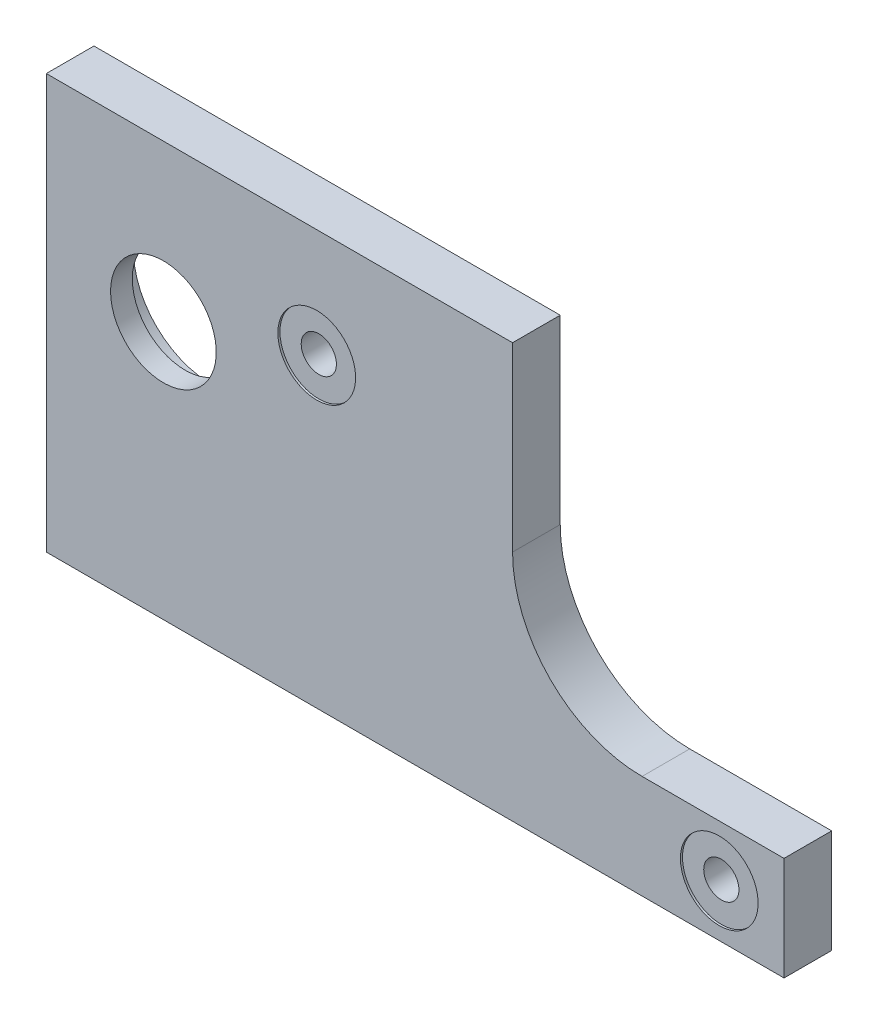
ISO-10303-21;
HEADER;
FILE_DESCRIPTION(('STEP AP214'),'2;1');
FILE_NAME('part.step','',(''),(''),'','','');
FILE_SCHEMA(('AUTOMOTIVE_DESIGN { 1 0 10303 214 1 1 1 1 }'));
ENDSEC;
DATA;
#1=APPLICATION_CONTEXT('core data for automotive mechanical design processes');
#2=APPLICATION_PROTOCOL_DEFINITION('international standard','automotive_design',2000,#1);
#3=PRODUCT_CONTEXT('',#1,'mechanical');
#4=PRODUCT('Part','Part','',(#3));
#5=PRODUCT_RELATED_PRODUCT_CATEGORY('part','',(#4));
#6=PRODUCT_DEFINITION_FORMATION('','',#4);
#7=PRODUCT_DEFINITION_CONTEXT('part definition',#1,'design');
#8=PRODUCT_DEFINITION('design','',#6,#7);
#9=PRODUCT_DEFINITION_SHAPE('','',#8);
#10=(LENGTH_UNIT() NAMED_UNIT(*) SI_UNIT(.MILLI.,.METRE.));
#11=(NAMED_UNIT(*) PLANE_ANGLE_UNIT() SI_UNIT($,.RADIAN.));
#12=(NAMED_UNIT(*) SI_UNIT($,.STERADIAN.) SOLID_ANGLE_UNIT());
#13=UNCERTAINTY_MEASURE_WITH_UNIT(LENGTH_MEASURE(1.E-05),#10,'distance_accuracy_value','');
#14=(GEOMETRIC_REPRESENTATION_CONTEXT(3) GLOBAL_UNCERTAINTY_ASSIGNED_CONTEXT((#13)) GLOBAL_UNIT_ASSIGNED_CONTEXT((#10,
#11,#12)) REPRESENTATION_CONTEXT('',''));
#15=CARTESIAN_POINT('',(0.,0.,0.));
#16=DIRECTION('',(0.,0.,1.));
#17=DIRECTION('',(1.,0.,0.));
#18=AXIS2_PLACEMENT_3D('',#15,#16,#17);
#19=CARTESIAN_POINT('',(85.6615,-47.625,7.4295));
#20=DIRECTION('',(0.,0.,-1.));
#21=DIRECTION('',(-1.,0.,0.));
#22=AXIS2_PLACEMENT_3D('',#19,#20,#21);
#23=CYLINDRICAL_SURFACE('',#22,2.15899999999999);
#24=CARTESIAN_POINT('',(85.6615,-47.625,1.5875));
#25=DIRECTION('',(0.,0.,-1.));
#26=DIRECTION('',(-1.,0.,0.));
#27=AXIS2_PLACEMENT_3D('',#24,#25,#26);
#28=CIRCLE('',#27,2.15899999999999);
#29=CARTESIAN_POINT('',(83.5025,-47.625,1.5875));
#30=VERTEX_POINT('',#29);
#31=EDGE_CURVE('E19',#30,#30,#28,.T.);
#32=ORIENTED_EDGE('',*,*,#31,.T.);
#33=EDGE_LOOP('',(#32));
#34=FACE_BOUND('',#33,.T.);
#35=CARTESIAN_POINT('',(85.6615,-47.625,7.1755));
#36=DIRECTION('',(0.,0.,-1.));
#37=DIRECTION('',(-1.,0.,0.));
#38=AXIS2_PLACEMENT_3D('',#35,#36,#37);
#39=CIRCLE('',#38,2.15899999999999);
#40=CARTESIAN_POINT('',(83.5025,-47.625,7.1755));
#41=VERTEX_POINT('',#40);
#42=EDGE_CURVE('E155',#41,#41,#39,.T.);
#43=ORIENTED_EDGE('',*,*,#42,.F.);
#44=EDGE_LOOP('',(#43));
#45=FACE_BOUND('',#44,.T.);
#46=ADVANCED_FACE('F16',(#34,#45),#23,.F.);
#47=CARTESIAN_POINT('',(36.322,-16.51,7.4295));
#48=DIRECTION('',(0.,0.,-1.));
#49=DIRECTION('',(-1.,0.,0.));
#50=AXIS2_PLACEMENT_3D('',#47,#48,#49);
#51=CYLINDRICAL_SURFACE('',#50,2.159);
#52=CARTESIAN_POINT('',(36.322,-16.51,1.5875));
#53=DIRECTION('',(0.,0.,-1.));
#54=DIRECTION('',(-1.,0.,0.));
#55=AXIS2_PLACEMENT_3D('',#52,#53,#54);
#56=CIRCLE('',#55,2.159);
#57=CARTESIAN_POINT('',(34.163,-16.51,1.5875));
#58=VERTEX_POINT('',#57);
#59=EDGE_CURVE('E160',#58,#58,#56,.T.);
#60=ORIENTED_EDGE('',*,*,#59,.T.);
#61=EDGE_LOOP('',(#60));
#62=FACE_BOUND('',#61,.T.);
#63=CARTESIAN_POINT('',(36.322,-16.51,7.1755));
#64=DIRECTION('',(0.,0.,-1.));
#65=DIRECTION('',(-1.,0.,0.));
#66=AXIS2_PLACEMENT_3D('',#63,#64,#65);
#67=CIRCLE('',#66,2.159);
#68=CARTESIAN_POINT('',(34.163,-16.51,7.1755));
#69=VERTEX_POINT('',#68);
#70=EDGE_CURVE('E152',#69,#69,#67,.T.);
#71=ORIENTED_EDGE('',*,*,#70,.F.);
#72=EDGE_LOOP('',(#71));
#73=FACE_BOUND('',#72,.T.);
#74=ADVANCED_FACE('F182',(#62,#73),#51,.F.);
#75=CARTESIAN_POINT('',(17.526,-22.352,1.5875));
#76=DIRECTION('',(0.,0.,1.));
#77=DIRECTION('',(1.,0.,0.));
#78=AXIS2_PLACEMENT_3D('',#75,#76,#77);
#79=CYLINDRICAL_SURFACE('',#78,9.525);
#80=CARTESIAN_POINT('',(17.526,-22.352,4.7625));
#81=DIRECTION('',(0.,0.,1.));
#82=DIRECTION('',(1.,0.,0.));
#83=AXIS2_PLACEMENT_3D('',#80,#81,#82);
#84=CIRCLE('',#83,9.525);
#85=CARTESIAN_POINT('',(27.051,-22.352,4.7625));
#86=VERTEX_POINT('',#85);
#87=EDGE_CURVE('E93',#86,#86,#84,.F.);
#88=ORIENTED_EDGE('',*,*,#87,.F.);
#89=EDGE_LOOP('',(#88));
#90=FACE_BOUND('',#89,.T.);
#91=CARTESIAN_POINT('',(17.526,-22.352,1.5875));
#92=DIRECTION('',(0.,0.,1.));
#93=DIRECTION('',(1.,0.,0.));
#94=AXIS2_PLACEMENT_3D('',#91,#92,#93);
#95=CIRCLE('',#94,9.525);
#96=CARTESIAN_POINT('',(27.051,-22.352,1.5875));
#97=VERTEX_POINT('',#96);
#98=EDGE_CURVE('E158',#97,#97,#95,.F.);
#99=ORIENTED_EDGE('',*,*,#98,.T.);
#100=EDGE_LOOP('',(#99));
#101=FACE_BOUND('',#100,.T.);
#102=ADVANCED_FACE('F171',(#90,#101),#79,.F.);
#103=CARTESIAN_POINT('',(48.387,-28.575,1.5875));
#104=DIRECTION('',(0.,0.,1.));
#105=DIRECTION('',(1.,0.,0.));
#106=AXIS2_PLACEMENT_3D('',#103,#104,#105);
#107=PLANE('',#106);
#108=ORIENTED_EDGE('',*,*,#98,.F.);
#109=EDGE_LOOP('',(#108));
#110=FACE_BOUND('',#109,.T.);
#111=ORIENTED_EDGE('',*,*,#59,.F.);
#112=EDGE_LOOP('',(#111));
#113=FACE_BOUND('',#112,.T.);
#114=ORIENTED_EDGE('',*,*,#31,.F.);
#115=EDGE_LOOP('',(#114));
#116=FACE_BOUND('',#115,.T.);
#117=CARTESIAN_POINT('',(76.2,-25.4,1.5875));
#118=DIRECTION('',(0.,0.,1.));
#119=DIRECTION('',(1.,0.,0.));
#120=AXIS2_PLACEMENT_3D('',#117,#118,#119);
#121=CIRCLE('',#120,15.875);
#122=CARTESIAN_POINT('',(60.325,-25.4,1.5875));
#123=VERTEX_POINT('',#122);
#124=CARTESIAN_POINT('',(76.2,-41.275,1.5875));
#125=VERTEX_POINT('',#124);
#126=EDGE_CURVE('E148',#123,#125,#121,.T.);
#127=ORIENTED_EDGE('',*,*,#126,.T.);
#128=DIRECTION('',(1.,0.,0.));
#129=VECTOR('',#128,1.);
#130=CARTESIAN_POINT('',(93.599,-41.275,1.5875));
#131=LINE('',#130,#129);
#132=CARTESIAN_POINT('',(93.599,-41.275,1.5875));
#133=VERTEX_POINT('',#132);
#134=EDGE_CURVE('E57',#133,#125,#131,.F.);
#135=ORIENTED_EDGE('',*,*,#134,.F.);
#136=DIRECTION('',(0.,1.,0.));
#137=VECTOR('',#136,1.);
#138=CARTESIAN_POINT('',(93.599,-53.975,1.5875));
#139=LINE('',#138,#137);
#140=CARTESIAN_POINT('',(93.599,-53.975,1.5875));
#141=VERTEX_POINT('',#140);
#142=EDGE_CURVE('E115',#141,#133,#139,.T.);
#143=ORIENTED_EDGE('',*,*,#142,.F.);
#144=DIRECTION('',(1.,0.,0.));
#145=VECTOR('',#144,1.);
#146=CARTESIAN_POINT('',(3.175,-53.975,1.5875));
#147=LINE('',#146,#145);
#148=CARTESIAN_POINT('',(3.175,-53.975,1.5875));
#149=VERTEX_POINT('',#148);
#150=EDGE_CURVE('E120',#149,#141,#147,.T.);
#151=ORIENTED_EDGE('',*,*,#150,.F.);
#152=DIRECTION('',(0.,1.,0.));
#153=VECTOR('',#152,1.);
#154=CARTESIAN_POINT('',(3.175,-3.17499999999992,1.5875));
#155=LINE('',#154,#153);
#156=CARTESIAN_POINT('',(3.175,-3.17499999999994,1.5875));
#157=VERTEX_POINT('',#156);
#158=EDGE_CURVE('E78',#157,#149,#155,.F.);
#159=ORIENTED_EDGE('',*,*,#158,.F.);
#160=DIRECTION('',(-1.,0.,0.));
#161=VECTOR('',#160,1.);
#162=CARTESIAN_POINT('',(60.325,-3.17499999999995,1.5875));
#163=LINE('',#162,#161);
#164=CARTESIAN_POINT('',(60.325,-3.17499999999995,1.5875));
#165=VERTEX_POINT('',#164);
#166=EDGE_CURVE('E80',#165,#157,#163,.T.);
#167=ORIENTED_EDGE('',*,*,#166,.F.);
#168=DIRECTION('',(0.,1.,0.));
#169=VECTOR('',#168,1.);
#170=CARTESIAN_POINT('',(60.325,-25.4,1.5875));
#171=LINE('',#170,#169);
#172=EDGE_CURVE('E52',#123,#165,#171,.T.);
#173=ORIENTED_EDGE('',*,*,#172,.F.);
#174=EDGE_LOOP('',(#127,#135,#143,#151,#159,#167,#173));
#175=FACE_BOUND('',#174,.T.);
#176=ADVANCED_FACE('F81',(#110,#113,#116,#175),#107,.F.);
#177=CARTESIAN_POINT('',(85.6615,-47.625,7.1755));
#178=DIRECTION('',(0.,0.,1.));
#179=DIRECTION('',(1.,0.,0.));
#180=AXIS2_PLACEMENT_3D('',#177,#178,#179);
#181=PLANE('',#180);
#182=ORIENTED_EDGE('',*,*,#42,.T.);
#183=EDGE_LOOP('',(#182));
#184=FACE_BOUND('',#183,.T.);
#185=CARTESIAN_POINT('',(85.6615,-47.625,7.1755));
#186=DIRECTION('',(0.,0.,-1.));
#187=DIRECTION('',(-1.,0.,0.));
#188=AXIS2_PLACEMENT_3D('',#185,#186,#187);
#189=CIRCLE('',#188,4.7625);
#190=CARTESIAN_POINT('',(80.899,-47.625,7.1755));
#191=VERTEX_POINT('',#190);
#192=EDGE_CURVE('E145',#191,#191,#189,.F.);
#193=ORIENTED_EDGE('',*,*,#192,.T.);
#194=EDGE_LOOP('',(#193));
#195=FACE_BOUND('',#194,.T.);
#196=ADVANCED_FACE('F170',(#184,#195),#181,.T.);
#197=CARTESIAN_POINT('',(36.322,-16.51,7.1755));
#198=DIRECTION('',(0.,0.,1.));
#199=DIRECTION('',(1.,0.,0.));
#200=AXIS2_PLACEMENT_3D('',#197,#198,#199);
#201=PLANE('',#200);
#202=ORIENTED_EDGE('',*,*,#70,.T.);
#203=EDGE_LOOP('',(#202));
#204=FACE_BOUND('',#203,.T.);
#205=CARTESIAN_POINT('',(36.322,-16.51,7.1755));
#206=DIRECTION('',(0.,0.,-1.));
#207=DIRECTION('',(-1.,0.,0.));
#208=AXIS2_PLACEMENT_3D('',#205,#206,#207);
#209=CIRCLE('',#208,4.7625);
#210=CARTESIAN_POINT('',(31.5595,-16.51,7.1755));
#211=VERTEX_POINT('',#210);
#212=EDGE_CURVE('E142',#211,#211,#209,.F.);
#213=ORIENTED_EDGE('',*,*,#212,.T.);
#214=EDGE_LOOP('',(#213));
#215=FACE_BOUND('',#214,.T.);
#216=ADVANCED_FACE('F179',(#204,#215),#201,.T.);
#217=CARTESIAN_POINT('',(17.526,-22.352,4.7625));
#218=DIRECTION('',(0.,0.,-1.));
#219=DIRECTION('',(-1.,0.,0.));
#220=AXIS2_PLACEMENT_3D('',#217,#218,#219);
#221=PLANE('',#220);
#222=CARTESIAN_POINT('',(17.526,-22.352,4.7625));
#223=DIRECTION('',(0.,0.,-1.));
#224=DIRECTION('',(-1.,0.,0.));
#225=AXIS2_PLACEMENT_3D('',#222,#223,#224);
#226=CIRCLE('',#225,6.477);
#227=CARTESIAN_POINT('',(11.049,-22.352,4.7625));
#228=VERTEX_POINT('',#227);
#229=EDGE_CURVE('E138',#228,#228,#226,.F.);
#230=ORIENTED_EDGE('',*,*,#229,.T.);
#231=EDGE_LOOP('',(#230));
#232=FACE_BOUND('',#231,.T.);
#233=ORIENTED_EDGE('',*,*,#87,.T.);
#234=EDGE_LOOP('',(#233));
#235=FACE_BOUND('',#234,.T.);
#236=ADVANCED_FACE('F230',(#232,#235),#221,.T.);
#237=CARTESIAN_POINT('',(60.325,-25.4,1.5875));
#238=DIRECTION('',(1.,0.,0.));
#239=DIRECTION('',(0.,0.,-1.));
#240=AXIS2_PLACEMENT_3D('',#237,#238,#239);
#241=PLANE('',#240);
#242=DIRECTION('',(0.,1.,0.));
#243=VECTOR('',#242,1.);
#244=CARTESIAN_POINT('',(60.325,-28.575,7.4295));
#245=LINE('',#244,#243);
#246=CARTESIAN_POINT('',(60.325,-25.4,7.4295));
#247=VERTEX_POINT('',#246);
#248=CARTESIAN_POINT('',(60.325,-3.17499999999995,7.4295));
#249=VERTEX_POINT('',#248);
#250=EDGE_CURVE('E141',#247,#249,#245,.T.);
#251=ORIENTED_EDGE('',*,*,#250,.F.);
#252=DIRECTION('',(0.,0.,1.));
#253=VECTOR('',#252,1.);
#254=CARTESIAN_POINT('',(60.325,-25.4,1.5875));
#255=LINE('',#254,#253);
#256=EDGE_CURVE('E91',#247,#123,#255,.F.);
#257=ORIENTED_EDGE('',*,*,#256,.T.);
#258=ORIENTED_EDGE('',*,*,#172,.T.);
#259=DIRECTION('',(0.,0.,1.));
#260=VECTOR('',#259,1.);
#261=CARTESIAN_POINT('',(60.325,-3.17499999999995,1.5875));
#262=LINE('',#261,#260);
#263=EDGE_CURVE('E85',#249,#165,#262,.F.);
#264=ORIENTED_EDGE('',*,*,#263,.F.);
#265=EDGE_LOOP('',(#251,#257,#258,#264));
#266=FACE_BOUND('',#265,.T.);
#267=ADVANCED_FACE('F88',(#266),#241,.T.);
#268=CARTESIAN_POINT('',(60.325,-3.17499999999995,1.5875));
#269=DIRECTION('',(0.,1.,0.));
#270=DIRECTION('',(-1.,0.,0.));
#271=AXIS2_PLACEMENT_3D('',#268,#269,#270);
#272=PLANE('',#271);
#273=DIRECTION('',(1.,0.,0.));
#274=VECTOR('',#273,1.);
#275=CARTESIAN_POINT('',(48.387,-3.17499999999995,7.4295));
#276=LINE('',#275,#274);
#277=CARTESIAN_POINT('',(3.175,-3.17499999999995,7.4295));
#278=VERTEX_POINT('',#277);
#279=EDGE_CURVE('E97',#249,#278,#276,.F.);
#280=ORIENTED_EDGE('',*,*,#279,.F.);
#281=ORIENTED_EDGE('',*,*,#263,.T.);
#282=ORIENTED_EDGE('',*,*,#166,.T.);
#283=DIRECTION('',(0.,0.,1.));
#284=VECTOR('',#283,1.);
#285=CARTESIAN_POINT('',(3.175,-3.17499999999995,1.5875));
#286=LINE('',#285,#284);
#287=EDGE_CURVE('E100',#278,#157,#286,.F.);
#288=ORIENTED_EDGE('',*,*,#287,.F.);
#289=EDGE_LOOP('',(#280,#281,#282,#288));
#290=FACE_BOUND('',#289,.T.);
#291=ADVANCED_FACE('F95',(#290),#272,.T.);
#292=CARTESIAN_POINT('',(3.175,-3.17499999999992,1.5875));
#293=DIRECTION('',(-1.,0.,0.));
#294=DIRECTION('',(0.,0.,1.));
#295=AXIS2_PLACEMENT_3D('',#292,#293,#294);
#296=PLANE('',#295);
#297=DIRECTION('',(0.,1.,0.));
#298=VECTOR('',#297,1.);
#299=CARTESIAN_POINT('',(3.175,-28.575,7.4295));
#300=LINE('',#299,#298);
#301=CARTESIAN_POINT('',(3.175,-53.975,7.4295));
#302=VERTEX_POINT('',#301);
#303=EDGE_CURVE('E272',#278,#302,#300,.F.);
#304=ORIENTED_EDGE('',*,*,#303,.F.);
#305=ORIENTED_EDGE('',*,*,#287,.T.);
#306=ORIENTED_EDGE('',*,*,#158,.T.);
#307=DIRECTION('',(0.,0.,1.));
#308=VECTOR('',#307,1.);
#309=CARTESIAN_POINT('',(3.175,-53.975,1.5875));
#310=LINE('',#309,#308);
#311=EDGE_CURVE('E117',#302,#149,#310,.F.);
#312=ORIENTED_EDGE('',*,*,#311,.F.);
#313=EDGE_LOOP('',(#304,#305,#306,#312));
#314=FACE_BOUND('',#313,.T.);
#315=ADVANCED_FACE('F221',(#314),#296,.T.);
#316=CARTESIAN_POINT('',(3.175,-53.975,1.5875));
#317=DIRECTION('',(0.,-1.,0.));
#318=DIRECTION('',(1.,0.,0.));
#319=AXIS2_PLACEMENT_3D('',#316,#317,#318);
#320=PLANE('',#319);
#321=DIRECTION('',(1.,0.,0.));
#322=VECTOR('',#321,1.);
#323=CARTESIAN_POINT('',(48.387,-53.975,7.4295));
#324=LINE('',#323,#322);
#325=CARTESIAN_POINT('',(93.599,-53.975,7.4295));
#326=VERTEX_POINT('',#325);
#327=EDGE_CURVE('E252',#302,#326,#324,.T.);
#328=ORIENTED_EDGE('',*,*,#327,.F.);
#329=ORIENTED_EDGE('',*,*,#311,.T.);
#330=ORIENTED_EDGE('',*,*,#150,.T.);
#331=DIRECTION('',(0.,0.,1.));
#332=VECTOR('',#331,1.);
#333=CARTESIAN_POINT('',(93.599,-53.975,1.5875));
#334=LINE('',#333,#332);
#335=EDGE_CURVE('E112',#326,#141,#334,.F.);
#336=ORIENTED_EDGE('',*,*,#335,.F.);
#337=EDGE_LOOP('',(#328,#329,#330,#336));
#338=FACE_BOUND('',#337,.T.);
#339=ADVANCED_FACE('F217',(#338),#320,.T.);
#340=CARTESIAN_POINT('',(93.599,-53.975,1.5875));
#341=DIRECTION('',(1.,0.,0.));
#342=DIRECTION('',(0.,1.,0.));
#343=AXIS2_PLACEMENT_3D('',#340,#341,#342);
#344=PLANE('',#343);
#345=DIRECTION('',(0.,1.,0.));
#346=VECTOR('',#345,1.);
#347=CARTESIAN_POINT('',(93.599,-28.575,7.4295));
#348=LINE('',#347,#346);
#349=CARTESIAN_POINT('',(93.599,-41.275,7.4295));
#350=VERTEX_POINT('',#349);
#351=EDGE_CURVE('E250',#326,#350,#348,.T.);
#352=ORIENTED_EDGE('',*,*,#351,.F.);
#353=ORIENTED_EDGE('',*,*,#335,.T.);
#354=ORIENTED_EDGE('',*,*,#142,.T.);
#355=DIRECTION('',(0.,0.,1.));
#356=VECTOR('',#355,1.);
#357=CARTESIAN_POINT('',(93.599,-41.275,1.5875));
#358=LINE('',#357,#356);
#359=EDGE_CURVE('E111',#350,#133,#358,.F.);
#360=ORIENTED_EDGE('',*,*,#359,.F.);
#361=EDGE_LOOP('',(#352,#353,#354,#360));
#362=FACE_BOUND('',#361,.T.);
#363=ADVANCED_FACE('F214',(#362),#344,.T.);
#364=CARTESIAN_POINT('',(93.599,-41.275,1.5875));
#365=DIRECTION('',(0.,1.,0.));
#366=DIRECTION('',(0.,0.,1.));
#367=AXIS2_PLACEMENT_3D('',#364,#365,#366);
#368=PLANE('',#367);
#369=DIRECTION('',(1.,0.,0.));
#370=VECTOR('',#369,1.);
#371=CARTESIAN_POINT('',(48.387,-41.275,7.4295));
#372=LINE('',#371,#370);
#373=CARTESIAN_POINT('',(76.2,-41.275,7.4295));
#374=VERTEX_POINT('',#373);
#375=EDGE_CURVE('E137',#350,#374,#372,.F.);
#376=ORIENTED_EDGE('',*,*,#375,.F.);
#377=ORIENTED_EDGE('',*,*,#359,.T.);
#378=ORIENTED_EDGE('',*,*,#134,.T.);
#379=DIRECTION('',(0.,0.,1.));
#380=VECTOR('',#379,1.);
#381=CARTESIAN_POINT('',(76.2,-41.275,1.5875));
#382=LINE('',#381,#380);
#383=EDGE_CURVE('E34',#125,#374,#382,.T.);
#384=ORIENTED_EDGE('',*,*,#383,.T.);
#385=EDGE_LOOP('',(#376,#377,#378,#384));
#386=FACE_BOUND('',#385,.T.);
#387=ADVANCED_FACE('F210',(#386),#368,.T.);
#388=CARTESIAN_POINT('',(76.2,-25.4,1.5875));
#389=DIRECTION('',(0.,0.,1.));
#390=DIRECTION('',(1.,0.,0.));
#391=AXIS2_PLACEMENT_3D('',#388,#389,#390);
#392=CYLINDRICAL_SURFACE('',#391,15.875);
#393=ORIENTED_EDGE('',*,*,#256,.F.);
#394=CARTESIAN_POINT('',(76.2,-25.4,7.4295));
#395=DIRECTION('',(0.,0.,1.));
#396=DIRECTION('',(1.,0.,0.));
#397=AXIS2_PLACEMENT_3D('',#394,#395,#396);
#398=CIRCLE('',#397,15.875);
#399=EDGE_CURVE('E134',#374,#247,#398,.F.);
#400=ORIENTED_EDGE('',*,*,#399,.F.);
#401=ORIENTED_EDGE('',*,*,#383,.F.);
#402=ORIENTED_EDGE('',*,*,#126,.F.);
#403=EDGE_LOOP('',(#393,#400,#401,#402));
#404=FACE_BOUND('',#403,.T.);
#405=ADVANCED_FACE('F206',(#404),#392,.F.);
#406=CARTESIAN_POINT('',(85.6615,-47.625,7.4295));
#407=DIRECTION('',(0.,0.,-1.));
#408=DIRECTION('',(-1.,0.,0.));
#409=AXIS2_PLACEMENT_3D('',#406,#407,#408);
#410=CYLINDRICAL_SURFACE('',#409,4.7625);
#411=ORIENTED_EDGE('',*,*,#192,.F.);
#412=EDGE_LOOP('',(#411));
#413=FACE_BOUND('',#412,.T.);
#414=CARTESIAN_POINT('',(85.6615,-47.625,7.4295));
#415=DIRECTION('',(0.,0.,-1.));
#416=DIRECTION('',(-1.,0.,0.));
#417=AXIS2_PLACEMENT_3D('',#414,#415,#416);
#418=CIRCLE('',#417,4.7625);
#419=CARTESIAN_POINT('',(80.899,-47.625,7.4295));
#420=VERTEX_POINT('',#419);
#421=EDGE_CURVE('E131',#420,#420,#418,.T.);
#422=ORIENTED_EDGE('',*,*,#421,.F.);
#423=EDGE_LOOP('',(#422));
#424=FACE_BOUND('',#423,.T.);
#425=ADVANCED_FACE('F202',(#413,#424),#410,.F.);
#426=CARTESIAN_POINT('',(36.322,-16.51,7.4295));
#427=DIRECTION('',(0.,0.,-1.));
#428=DIRECTION('',(-1.,0.,0.));
#429=AXIS2_PLACEMENT_3D('',#426,#427,#428);
#430=CYLINDRICAL_SURFACE('',#429,4.7625);
#431=ORIENTED_EDGE('',*,*,#212,.F.);
#432=EDGE_LOOP('',(#431));
#433=FACE_BOUND('',#432,.T.);
#434=CARTESIAN_POINT('',(36.322,-16.51,7.4295));
#435=DIRECTION('',(0.,0.,-1.));
#436=DIRECTION('',(-1.,0.,0.));
#437=AXIS2_PLACEMENT_3D('',#434,#435,#436);
#438=CIRCLE('',#437,4.7625);
#439=CARTESIAN_POINT('',(31.5595,-16.51,7.4295));
#440=VERTEX_POINT('',#439);
#441=EDGE_CURVE('E25',#440,#440,#438,.T.);
#442=ORIENTED_EDGE('',*,*,#441,.F.);
#443=EDGE_LOOP('',(#442));
#444=FACE_BOUND('',#443,.T.);
#445=ADVANCED_FACE('F195',(#433,#444),#430,.F.);
#446=CARTESIAN_POINT('',(17.526,-22.352,7.4295));
#447=DIRECTION('',(0.,0.,-1.));
#448=DIRECTION('',(-1.,0.,0.));
#449=AXIS2_PLACEMENT_3D('',#446,#447,#448);
#450=CYLINDRICAL_SURFACE('',#449,6.477);
#451=ORIENTED_EDGE('',*,*,#229,.F.);
#452=EDGE_LOOP('',(#451));
#453=FACE_BOUND('',#452,.T.);
#454=CARTESIAN_POINT('',(17.526,-22.352,7.4295));
#455=DIRECTION('',(0.,0.,-1.));
#456=DIRECTION('',(-1.,0.,0.));
#457=AXIS2_PLACEMENT_3D('',#454,#455,#456);
#458=CIRCLE('',#457,6.477);
#459=CARTESIAN_POINT('',(11.049,-22.352,7.4295));
#460=VERTEX_POINT('',#459);
#461=EDGE_CURVE('E11',#460,#460,#458,.T.);
#462=ORIENTED_EDGE('',*,*,#461,.F.);
#463=EDGE_LOOP('',(#462));
#464=FACE_BOUND('',#463,.T.);
#465=ADVANCED_FACE('F189',(#453,#464),#450,.F.);
#466=CARTESIAN_POINT('',(48.387,-28.575,7.4295));
#467=DIRECTION('',(0.,0.,1.));
#468=DIRECTION('',(1.,0.,0.));
#469=AXIS2_PLACEMENT_3D('',#466,#467,#468);
#470=PLANE('',#469);
#471=ORIENTED_EDGE('',*,*,#461,.T.);
#472=EDGE_LOOP('',(#471));
#473=FACE_BOUND('',#472,.T.);
#474=ORIENTED_EDGE('',*,*,#441,.T.);
#475=EDGE_LOOP('',(#474));
#476=FACE_BOUND('',#475,.T.);
#477=ORIENTED_EDGE('',*,*,#421,.T.);
#478=EDGE_LOOP('',(#477));
#479=FACE_BOUND('',#478,.T.);
#480=ORIENTED_EDGE('',*,*,#375,.T.);
#481=ORIENTED_EDGE('',*,*,#399,.T.);
#482=ORIENTED_EDGE('',*,*,#250,.T.);
#483=ORIENTED_EDGE('',*,*,#279,.T.);
#484=ORIENTED_EDGE('',*,*,#303,.T.);
#485=ORIENTED_EDGE('',*,*,#327,.T.);
#486=ORIENTED_EDGE('',*,*,#351,.T.);
#487=EDGE_LOOP('',(#480,#481,#482,#483,#484,#485,#486));
#488=FACE_BOUND('',#487,.T.);
#489=ADVANCED_FACE('F187',(#473,#476,#479,#488),#470,.T.);
#490=CLOSED_SHELL('',(#46,#74,#102,#176,#196,#216,#236,#267,#291,#315,#339,#363,#387,#405,#425,
#445,#465,#489));
#491=MANIFOLD_SOLID_BREP('B1',#490);
#492=ADVANCED_BREP_SHAPE_REPRESENTATION('',(#18,#491),#14);
#493=SHAPE_DEFINITION_REPRESENTATION(#9,#492);
ENDSEC;
END-ISO-10303-21;
